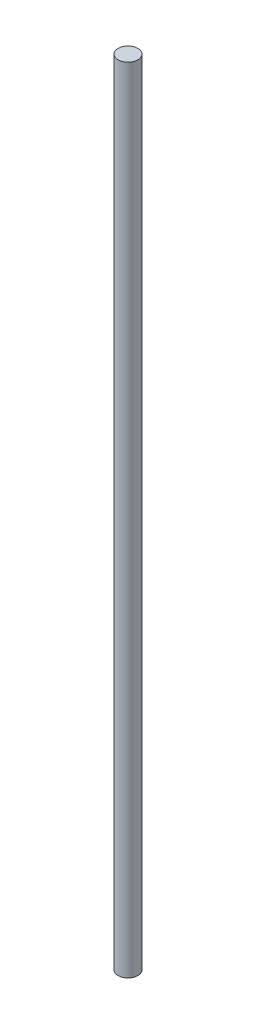
ISO-10303-21;
HEADER;
FILE_DESCRIPTION(('STEP AP214'),'2;1');
FILE_NAME('part.step','',(''),(''),'','','');
FILE_SCHEMA(('AUTOMOTIVE_DESIGN { 1 0 10303 214 1 1 1 1 }'));
ENDSEC;
DATA;
#1=APPLICATION_CONTEXT('core data for automotive mechanical design processes');
#2=APPLICATION_PROTOCOL_DEFINITION('international standard','automotive_design',2000,#1);
#3=PRODUCT_CONTEXT('',#1,'mechanical');
#4=PRODUCT('Part','Part','',(#3));
#5=PRODUCT_RELATED_PRODUCT_CATEGORY('part','',(#4));
#6=PRODUCT_DEFINITION_FORMATION('','',#4);
#7=PRODUCT_DEFINITION_CONTEXT('part definition',#1,'design');
#8=PRODUCT_DEFINITION('design','',#6,#7);
#9=PRODUCT_DEFINITION_SHAPE('','',#8);
#10=(LENGTH_UNIT() NAMED_UNIT(*) SI_UNIT(.MILLI.,.METRE.));
#11=(NAMED_UNIT(*) PLANE_ANGLE_UNIT() SI_UNIT($,.RADIAN.));
#12=(NAMED_UNIT(*) SI_UNIT($,.STERADIAN.) SOLID_ANGLE_UNIT());
#13=UNCERTAINTY_MEASURE_WITH_UNIT(LENGTH_MEASURE(1.E-05),#10,'distance_accuracy_value','');
#14=(GEOMETRIC_REPRESENTATION_CONTEXT(3) GLOBAL_UNCERTAINTY_ASSIGNED_CONTEXT((#13)) GLOBAL_UNIT_ASSIGNED_CONTEXT((#10,
#11,#12)) REPRESENTATION_CONTEXT('',''));
#15=CARTESIAN_POINT('',(0.,0.,0.));
#16=DIRECTION('',(0.,0.,1.));
#17=DIRECTION('',(1.,0.,0.));
#18=AXIS2_PLACEMENT_3D('',#15,#16,#17);
#19=CARTESIAN_POINT('',(0.,508.,0.));
#20=DIRECTION('',(0.,-1.,0.));
#21=DIRECTION('',(0.,0.,-1.));
#22=AXIS2_PLACEMENT_3D('',#19,#20,#21);
#23=CYLINDRICAL_SURFACE('',#22,6.35);
#24=CARTESIAN_POINT('',(0.,508.,0.));
#25=DIRECTION('',(0.,1.,0.));
#26=DIRECTION('',(0.,0.,1.));
#27=AXIS2_PLACEMENT_3D('',#24,#25,#26);
#28=CIRCLE('',#27,6.35);
#29=CARTESIAN_POINT('',(0.,508.,6.35));
#30=VERTEX_POINT('',#29);
#31=EDGE_CURVE('E10',#30,#30,#28,.T.);
#32=ORIENTED_EDGE('',*,*,#31,.F.);
#33=EDGE_LOOP('',(#32));
#34=FACE_BOUND('',#33,.T.);
#35=CARTESIAN_POINT('',(0.,0.,0.));
#36=DIRECTION('',(0.,1.,0.));
#37=DIRECTION('',(0.,0.,1.));
#38=AXIS2_PLACEMENT_3D('',#35,#36,#37);
#39=CIRCLE('',#38,6.35);
#40=CARTESIAN_POINT('',(0.,0.,6.35));
#41=VERTEX_POINT('',#40);
#42=EDGE_CURVE('E40',#41,#41,#39,.T.);
#43=ORIENTED_EDGE('',*,*,#42,.T.);
#44=EDGE_LOOP('',(#43));
#45=FACE_BOUND('',#44,.T.);
#46=ADVANCED_FACE('F37',(#34,#45),#23,.T.);
#47=CARTESIAN_POINT('',(0.,508.,0.));
#48=DIRECTION('',(0.,1.,0.));
#49=DIRECTION('',(0.,0.,1.));
#50=AXIS2_PLACEMENT_3D('',#47,#48,#49);
#51=PLANE('',#50);
#52=ORIENTED_EDGE('',*,*,#31,.T.);
#53=EDGE_LOOP('',(#52));
#54=FACE_BOUND('',#53,.T.);
#55=ADVANCED_FACE('F54',(#54),#51,.T.);
#56=CARTESIAN_POINT('',(0.,0.,0.));
#57=DIRECTION('',(0.,1.,0.));
#58=DIRECTION('',(0.,0.,1.));
#59=AXIS2_PLACEMENT_3D('',#56,#57,#58);
#60=PLANE('',#59);
#61=ORIENTED_EDGE('',*,*,#42,.F.);
#62=EDGE_LOOP('',(#61));
#63=FACE_BOUND('',#62,.T.);
#64=ADVANCED_FACE('F52',(#63),#60,.F.);
#65=CLOSED_SHELL('',(#46,#55,#64));
#66=MANIFOLD_SOLID_BREP('B2',#65);
#67=ADVANCED_BREP_SHAPE_REPRESENTATION('',(#18,#66),#14);
#68=SHAPE_DEFINITION_REPRESENTATION(#9,#67);
ENDSEC;
END-ISO-10303-21;
